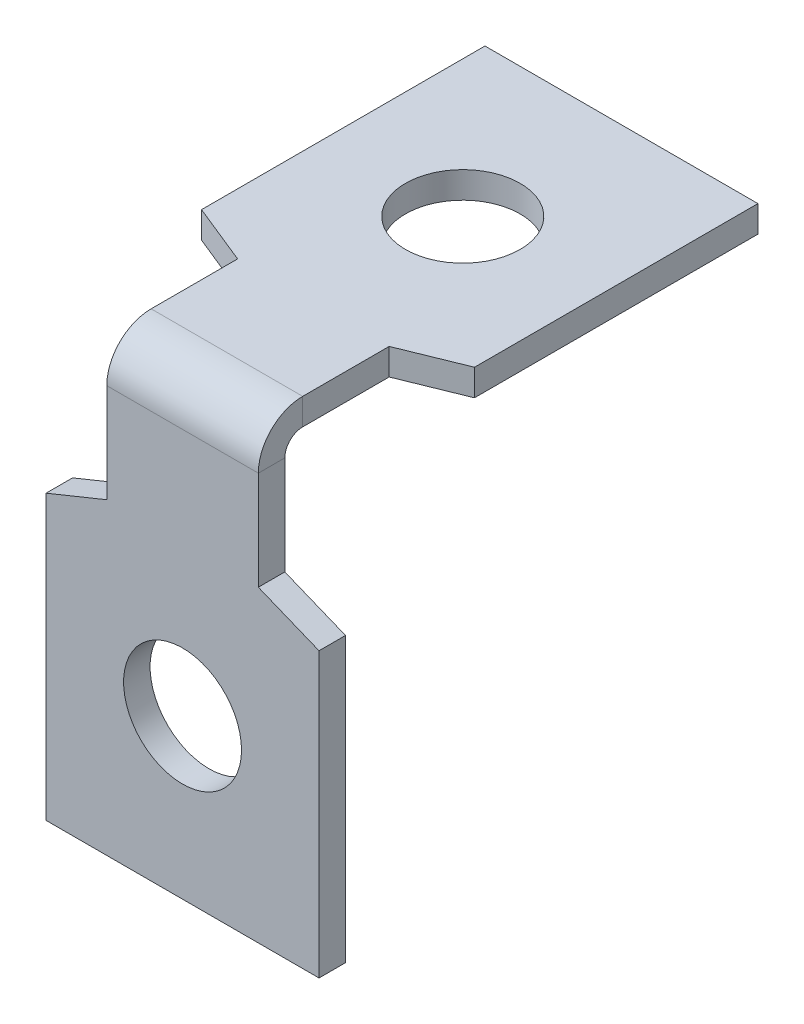
ISO-10303-21;
HEADER;
FILE_DESCRIPTION(('STEP AP214'),'2;1');
FILE_NAME('part.step','',(''),(''),'','','');
FILE_SCHEMA(('AUTOMOTIVE_DESIGN { 1 0 10303 214 1 1 1 1 }'));
ENDSEC;
DATA;
#1=APPLICATION_CONTEXT('core data for automotive mechanical design processes');
#2=APPLICATION_PROTOCOL_DEFINITION('international standard','automotive_design',2000,#1);
#3=PRODUCT_CONTEXT('',#1,'mechanical');
#4=PRODUCT('Part','Part','',(#3));
#5=PRODUCT_RELATED_PRODUCT_CATEGORY('part','',(#4));
#6=PRODUCT_DEFINITION_FORMATION('','',#4);
#7=PRODUCT_DEFINITION_CONTEXT('part definition',#1,'design');
#8=PRODUCT_DEFINITION('design','',#6,#7);
#9=PRODUCT_DEFINITION_SHAPE('','',#8);
#10=(LENGTH_UNIT() NAMED_UNIT(*) SI_UNIT(.MILLI.,.METRE.));
#11=(NAMED_UNIT(*) PLANE_ANGLE_UNIT() SI_UNIT($,.RADIAN.));
#12=(NAMED_UNIT(*) SI_UNIT($,.STERADIAN.) SOLID_ANGLE_UNIT());
#13=UNCERTAINTY_MEASURE_WITH_UNIT(LENGTH_MEASURE(1.E-05),#10,'distance_accuracy_value','');
#14=(GEOMETRIC_REPRESENTATION_CONTEXT(3) GLOBAL_UNCERTAINTY_ASSIGNED_CONTEXT((#13)) GLOBAL_UNIT_ASSIGNED_CONTEXT((#10,
#11,#12)) REPRESENTATION_CONTEXT('',''));
#15=CARTESIAN_POINT('',(0.,0.,0.));
#16=DIRECTION('',(0.,0.,1.));
#17=DIRECTION('',(1.,0.,0.));
#18=AXIS2_PLACEMENT_3D('',#15,#16,#17);
#19=CARTESIAN_POINT('',(0.,12.0608697758101,10.4181302241899));
#20=DIRECTION('',(0.,-1.,0.));
#21=DIRECTION('',(-1.,0.,0.));
#22=AXIS2_PLACEMENT_3D('',#19,#20,#21);
#23=PLANE('',#22);
#24=CARTESIAN_POINT('',(0.,12.0608697758101,-11.5528697758101));
#25=DIRECTION('',(0.,1.,0.));
#26=DIRECTION('',(1.,0.,0.));
#27=AXIS2_PLACEMENT_3D('',#24,#25,#26);
#28=CIRCLE('',#27,2.36295847969978);
#29=CARTESIAN_POINT('',(2.36295847969978,12.0608697758101,-11.5528697758101));
#30=VERTEX_POINT('',#29);
#31=EDGE_CURVE('E231',#30,#30,#28,.T.);
#32=ORIENTED_EDGE('',*,*,#31,.F.);
#33=EDGE_LOOP('',(#32));
#34=FACE_BOUND('',#33,.T.);
#35=DIRECTION('',(0.,0.,1.));
#36=VECTOR('',#35,1.);
#37=CARTESIAN_POINT('',(-3.1242,12.0608697758101,4.25863022418991));
#38=LINE('',#37,#36);
#39=CARTESIAN_POINT('',(-3.1242,12.0608697758101,-5.39336977581008));
#40=VERTEX_POINT('',#39);
#41=CARTESIAN_POINT('',(-3.1242,12.0608697758101,-1.8288));
#42=VERTEX_POINT('',#41);
#43=EDGE_CURVE('E58',#40,#42,#38,.T.);
#44=ORIENTED_EDGE('',*,*,#43,.T.);
#45=DIRECTION('',(1.,0.,0.));
#46=VECTOR('',#45,1.);
#47=CARTESIAN_POINT('',(0.,12.0608697758101,-1.8288));
#48=LINE('',#47,#46);
#49=CARTESIAN_POINT('',(3.1242,12.0608697758101,-1.8288));
#50=VERTEX_POINT('',#49);
#51=EDGE_CURVE('E50',#42,#50,#48,.T.);
#52=ORIENTED_EDGE('',*,*,#51,.T.);
#53=DIRECTION('',(0.,0.,-1.));
#54=VECTOR('',#53,1.);
#55=CARTESIAN_POINT('',(3.1242,12.0608697758101,-5.39336977581008));
#56=LINE('',#55,#54);
#57=CARTESIAN_POINT('',(3.1242,12.0608697758101,-5.39336977581008));
#58=VERTEX_POINT('',#57);
#59=EDGE_CURVE('E66',#50,#58,#56,.T.);
#60=ORIENTED_EDGE('',*,*,#59,.T.);
#61=DIRECTION('',(0.926517818130893,0.,-0.376250890611529));
#62=VECTOR('',#61,1.);
#63=CARTESIAN_POINT('',(5.6261,12.0608697758101,-6.40936977581008));
#64=LINE('',#63,#62);
#65=CARTESIAN_POINT('',(5.6261,12.0608697758101,-6.40936977581008));
#66=VERTEX_POINT('',#65);
#67=EDGE_CURVE('E257',#58,#66,#64,.T.);
#68=ORIENTED_EDGE('',*,*,#67,.T.);
#69=DIRECTION('',(0.,0.,-1.));
#70=VECTOR('',#69,1.);
#71=CARTESIAN_POINT('',(5.6261,12.06086977581,-18.0933697758101));
#72=LINE('',#71,#70);
#73=CARTESIAN_POINT('',(5.6261,12.06086977581,-18.0933697758101));
#74=VERTEX_POINT('',#73);
#75=EDGE_CURVE('E260',#66,#74,#72,.T.);
#76=ORIENTED_EDGE('',*,*,#75,.T.);
#77=DIRECTION('',(-1.,0.,0.));
#78=VECTOR('',#77,1.);
#79=CARTESIAN_POINT('',(-5.6261,12.06086977581,-18.0933697758101));
#80=LINE('',#79,#78);
#81=CARTESIAN_POINT('',(-5.6261,12.06086977581,-18.0933697758101));
#82=VERTEX_POINT('',#81);
#83=EDGE_CURVE('E239',#74,#82,#80,.T.);
#84=ORIENTED_EDGE('',*,*,#83,.T.);
#85=DIRECTION('',(0.,0.,1.));
#86=VECTOR('',#85,1.);
#87=CARTESIAN_POINT('',(-5.6261,12.0608697758101,-6.40936977581008));
#88=LINE('',#87,#86);
#89=CARTESIAN_POINT('',(-5.6261,12.0608697758101,-6.40936977581008));
#90=VERTEX_POINT('',#89);
#91=EDGE_CURVE('E230',#82,#90,#88,.T.);
#92=ORIENTED_EDGE('',*,*,#91,.T.);
#93=DIRECTION('',(0.926517818130893,0.,0.376250890611529));
#94=VECTOR('',#93,1.);
#95=CARTESIAN_POINT('',(-3.1242,12.0608697758101,-5.39336977581008));
#96=LINE('',#95,#94);
#97=EDGE_CURVE('E255',#90,#40,#96,.T.);
#98=ORIENTED_EDGE('',*,*,#97,.T.);
#99=EDGE_LOOP('',(#44,#52,#60,#68,#76,#84,#92,#98));
#100=FACE_BOUND('',#99,.T.);
#101=ADVANCED_FACE('F41',(#34,#100),#23,.F.);
#102=CARTESIAN_POINT('',(-5.6261,10.9686697758101,-6.40936977581008));
#103=DIRECTION('',(-1.,0.,0.));
#104=DIRECTION('',(0.,1.,0.));
#105=AXIS2_PLACEMENT_3D('',#102,#103,#104);
#106=PLANE('',#105);
#107=ORIENTED_EDGE('',*,*,#91,.F.);
#108=DIRECTION('',(0.,1.,0.));
#109=VECTOR('',#108,1.);
#110=CARTESIAN_POINT('',(-5.6261,10.96866977581,-18.0933697758101));
#111=LINE('',#110,#109);
#112=CARTESIAN_POINT('',(-5.6261,10.96866977581,-18.0933697758101));
#113=VERTEX_POINT('',#112);
#114=EDGE_CURVE('E265',#113,#82,#111,.T.);
#115=ORIENTED_EDGE('',*,*,#114,.F.);
#116=DIRECTION('',(0.,0.,1.));
#117=VECTOR('',#116,1.);
#118=CARTESIAN_POINT('',(-5.6261,10.9686697758101,-6.40936977581008));
#119=LINE('',#118,#117);
#120=CARTESIAN_POINT('',(-5.6261,10.9686697758101,-6.40936977581008));
#121=VERTEX_POINT('',#120);
#122=EDGE_CURVE('E235',#113,#121,#119,.T.);
#123=ORIENTED_EDGE('',*,*,#122,.T.);
#124=DIRECTION('',(0.,1.,0.));
#125=VECTOR('',#124,1.);
#126=CARTESIAN_POINT('',(-5.6261,10.9686697758101,-6.40936977581008));
#127=LINE('',#126,#125);
#128=EDGE_CURVE('E252',#121,#90,#127,.T.);
#129=ORIENTED_EDGE('',*,*,#128,.T.);
#130=EDGE_LOOP('',(#107,#115,#123,#129));
#131=FACE_BOUND('',#130,.T.);
#132=ADVANCED_FACE('F301',(#131),#106,.T.);
#133=CARTESIAN_POINT('',(-5.6261,10.96866977581,-18.0933697758101));
#134=DIRECTION('',(0.,0.,-1.));
#135=DIRECTION('',(0.,1.,0.));
#136=AXIS2_PLACEMENT_3D('',#133,#134,#135);
#137=PLANE('',#136);
#138=ORIENTED_EDGE('',*,*,#83,.F.);
#139=DIRECTION('',(0.,1.,0.));
#140=VECTOR('',#139,1.);
#141=CARTESIAN_POINT('',(5.6261,10.96866977581,-18.0933697758101));
#142=LINE('',#141,#140);
#143=CARTESIAN_POINT('',(5.6261,10.96866977581,-18.0933697758101));
#144=VERTEX_POINT('',#143);
#145=EDGE_CURVE('E267',#144,#74,#142,.T.);
#146=ORIENTED_EDGE('',*,*,#145,.F.);
#147=DIRECTION('',(-1.,0.,0.));
#148=VECTOR('',#147,1.);
#149=CARTESIAN_POINT('',(-5.6261,10.96866977581,-18.0933697758101));
#150=LINE('',#149,#148);
#151=EDGE_CURVE('E249',#144,#113,#150,.T.);
#152=ORIENTED_EDGE('',*,*,#151,.T.);
#153=ORIENTED_EDGE('',*,*,#114,.T.);
#154=EDGE_LOOP('',(#138,#146,#152,#153));
#155=FACE_BOUND('',#154,.T.);
#156=ADVANCED_FACE('F296',(#155),#137,.T.);
#157=CARTESIAN_POINT('',(5.6261,10.96866977581,-18.0933697758101));
#158=DIRECTION('',(1.,0.,0.));
#159=DIRECTION('',(0.,0.,-1.));
#160=AXIS2_PLACEMENT_3D('',#157,#158,#159);
#161=PLANE('',#160);
#162=ORIENTED_EDGE('',*,*,#75,.F.);
#163=DIRECTION('',(0.,1.,0.));
#164=VECTOR('',#163,1.);
#165=CARTESIAN_POINT('',(5.6261,10.9686697758101,-6.40936977581008));
#166=LINE('',#165,#164);
#167=CARTESIAN_POINT('',(5.6261,10.9686697758101,-6.40936977581008));
#168=VERTEX_POINT('',#167);
#169=EDGE_CURVE('E269',#168,#66,#166,.T.);
#170=ORIENTED_EDGE('',*,*,#169,.F.);
#171=DIRECTION('',(0.,0.,-1.));
#172=VECTOR('',#171,1.);
#173=CARTESIAN_POINT('',(5.6261,10.96866977581,-18.0933697758101));
#174=LINE('',#173,#172);
#175=EDGE_CURVE('E246',#168,#144,#174,.T.);
#176=ORIENTED_EDGE('',*,*,#175,.T.);
#177=ORIENTED_EDGE('',*,*,#145,.T.);
#178=EDGE_LOOP('',(#162,#170,#176,#177));
#179=FACE_BOUND('',#178,.T.);
#180=ADVANCED_FACE('F293',(#179),#161,.T.);
#181=CARTESIAN_POINT('',(5.6261,10.9686697758101,-6.40936977581008));
#182=DIRECTION('',(0.376250890611529,0.,0.926517818130893));
#183=DIRECTION('',(0.926517818130893,0.,-0.376250890611529));
#184=AXIS2_PLACEMENT_3D('',#181,#182,#183);
#185=PLANE('',#184);
#186=ORIENTED_EDGE('',*,*,#67,.F.);
#187=DIRECTION('',(0.,1.,0.));
#188=VECTOR('',#187,1.);
#189=CARTESIAN_POINT('',(3.1242,10.9686697758101,-5.39336977581008));
#190=LINE('',#189,#188);
#191=CARTESIAN_POINT('',(3.1242,10.9686697758101,-5.39336977581008));
#192=VERTEX_POINT('',#191);
#193=EDGE_CURVE('E271',#192,#58,#190,.T.);
#194=ORIENTED_EDGE('',*,*,#193,.F.);
#195=DIRECTION('',(0.926517818130893,0.,-0.376250890611529));
#196=VECTOR('',#195,1.);
#197=CARTESIAN_POINT('',(5.6261,10.9686697758101,-6.40936977581008));
#198=LINE('',#197,#196);
#199=EDGE_CURVE('E243',#192,#168,#198,.T.);
#200=ORIENTED_EDGE('',*,*,#199,.T.);
#201=ORIENTED_EDGE('',*,*,#169,.T.);
#202=EDGE_LOOP('',(#186,#194,#200,#201));
#203=FACE_BOUND('',#202,.T.);
#204=ADVANCED_FACE('F289',(#203),#185,.T.);
#205=CARTESIAN_POINT('',(3.1242,10.9686697758101,-5.39336977581008));
#206=DIRECTION('',(1.,0.,0.));
#207=DIRECTION('',(0.,-1.,0.));
#208=AXIS2_PLACEMENT_3D('',#205,#206,#207);
#209=PLANE('',#208);
#210=DIRECTION('',(0.,1.,0.));
#211=VECTOR('',#210,1.);
#212=CARTESIAN_POINT('',(3.1242,10.9686697758101,-1.8288));
#213=LINE('',#212,#211);
#214=CARTESIAN_POINT('',(3.1242,10.9686697758101,-1.82880000000001));
#215=VERTEX_POINT('',#214);
#216=EDGE_CURVE('E277',#215,#50,#213,.T.);
#217=ORIENTED_EDGE('',*,*,#216,.F.);
#218=DIRECTION('',(0.,0.,-1.));
#219=VECTOR('',#218,1.);
#220=CARTESIAN_POINT('',(3.1242,10.9686697758101,-5.39336977581008));
#221=LINE('',#220,#219);
#222=EDGE_CURVE('E45',#215,#192,#221,.T.);
#223=ORIENTED_EDGE('',*,*,#222,.T.);
#224=ORIENTED_EDGE('',*,*,#193,.T.);
#225=ORIENTED_EDGE('',*,*,#59,.F.);
#226=EDGE_LOOP('',(#217,#223,#224,#225));
#227=FACE_BOUND('',#226,.T.);
#228=ADVANCED_FACE('F285',(#227),#209,.T.);
#229=CARTESIAN_POINT('',(-3.1242,10.9686697758101,4.25863022418992));
#230=DIRECTION('',(-1.,0.,0.));
#231=DIRECTION('',(0.,1.,0.));
#232=AXIS2_PLACEMENT_3D('',#229,#230,#231);
#233=PLANE('',#232);
#234=DIRECTION('',(0.,-1.,0.));
#235=VECTOR('',#234,1.);
#236=CARTESIAN_POINT('',(-3.1242,10.9686697758101,-1.8288));
#237=LINE('',#236,#235);
#238=CARTESIAN_POINT('',(-3.1242,10.9686697758101,-1.8288));
#239=VERTEX_POINT('',#238);
#240=EDGE_CURVE('E12',#42,#239,#237,.T.);
#241=ORIENTED_EDGE('',*,*,#240,.F.);
#242=ORIENTED_EDGE('',*,*,#43,.F.);
#243=DIRECTION('',(0.,1.,0.));
#244=VECTOR('',#243,1.);
#245=CARTESIAN_POINT('',(-3.1242,10.9686697758101,-5.39336977581008));
#246=LINE('',#245,#244);
#247=CARTESIAN_POINT('',(-3.1242,10.9686697758101,-5.39336977581008));
#248=VERTEX_POINT('',#247);
#249=EDGE_CURVE('E273',#248,#40,#246,.T.);
#250=ORIENTED_EDGE('',*,*,#249,.F.);
#251=DIRECTION('',(0.,0.,1.));
#252=VECTOR('',#251,1.);
#253=CARTESIAN_POINT('',(-3.1242,10.9686697758101,4.25863022418992));
#254=LINE('',#253,#252);
#255=EDGE_CURVE('E242',#248,#239,#254,.T.);
#256=ORIENTED_EDGE('',*,*,#255,.T.);
#257=EDGE_LOOP('',(#241,#242,#250,#256));
#258=FACE_BOUND('',#257,.T.);
#259=ADVANCED_FACE('F43',(#258),#233,.T.);
#260=CARTESIAN_POINT('',(-3.1242,10.9686697758101,-5.39336977581008));
#261=DIRECTION('',(-0.376250890611529,0.,0.926517818130893));
#262=DIRECTION('',(0.926517818130893,0.,0.376250890611529));
#263=AXIS2_PLACEMENT_3D('',#260,#261,#262);
#264=PLANE('',#263);
#265=ORIENTED_EDGE('',*,*,#97,.F.);
#266=ORIENTED_EDGE('',*,*,#128,.F.);
#267=DIRECTION('',(0.926517818130893,0.,0.376250890611529));
#268=VECTOR('',#267,1.);
#269=CARTESIAN_POINT('',(-3.1242,10.9686697758101,-5.39336977581008));
#270=LINE('',#269,#268);
#271=EDGE_CURVE('E238',#121,#248,#270,.T.);
#272=ORIENTED_EDGE('',*,*,#271,.T.);
#273=ORIENTED_EDGE('',*,*,#249,.T.);
#274=EDGE_LOOP('',(#265,#266,#272,#273));
#275=FACE_BOUND('',#274,.T.);
#276=ADVANCED_FACE('F304',(#275),#264,.T.);
#277=CARTESIAN_POINT('',(0.,10.9686697758101,10.4181302241899));
#278=DIRECTION('',(0.,-1.,0.));
#279=DIRECTION('',(-1.,0.,0.));
#280=AXIS2_PLACEMENT_3D('',#277,#278,#279);
#281=PLANE('',#280);
#282=DIRECTION('',(1.,0.,0.));
#283=VECTOR('',#282,1.);
#284=CARTESIAN_POINT('',(0.,10.9686697758101,-1.8288));
#285=LINE('',#284,#283);
#286=EDGE_CURVE('E178',#239,#215,#285,.T.);
#287=ORIENTED_EDGE('',*,*,#286,.F.);
#288=ORIENTED_EDGE('',*,*,#255,.F.);
#289=ORIENTED_EDGE('',*,*,#271,.F.);
#290=ORIENTED_EDGE('',*,*,#122,.F.);
#291=ORIENTED_EDGE('',*,*,#151,.F.);
#292=ORIENTED_EDGE('',*,*,#175,.F.);
#293=ORIENTED_EDGE('',*,*,#199,.F.);
#294=ORIENTED_EDGE('',*,*,#222,.F.);
#295=EDGE_LOOP('',(#287,#288,#289,#290,#291,#292,#293,#294));
#296=FACE_BOUND('',#295,.T.);
#297=CARTESIAN_POINT('',(0.,10.9686697758101,-11.5528697758101));
#298=DIRECTION('',(0.,1.,0.));
#299=DIRECTION('',(1.,0.,0.));
#300=AXIS2_PLACEMENT_3D('',#297,#298,#299);
#301=CIRCLE('',#300,2.36295847969978);
#302=CARTESIAN_POINT('',(2.36295847969978,10.9686697758101,-11.5528697758101));
#303=VERTEX_POINT('',#302);
#304=EDGE_CURVE('E227',#303,#303,#301,.T.);
#305=ORIENTED_EDGE('',*,*,#304,.T.);
#306=EDGE_LOOP('',(#305));
#307=FACE_BOUND('',#306,.T.);
#308=ADVANCED_FACE('F387',(#296,#307),#281,.T.);
#309=CARTESIAN_POINT('',(0.,10.9686697758101,-11.5528697758101));
#310=DIRECTION('',(0.,1.,0.));
#311=DIRECTION('',(1.,0.,0.));
#312=AXIS2_PLACEMENT_3D('',#309,#310,#311);
#313=CYLINDRICAL_SURFACE('',#312,2.36295847969978);
#314=ORIENTED_EDGE('',*,*,#304,.F.);
#315=EDGE_LOOP('',(#314));
#316=FACE_BOUND('',#315,.T.);
#317=ORIENTED_EDGE('',*,*,#31,.T.);
#318=EDGE_LOOP('',(#317));
#319=FACE_BOUND('',#318,.T.);
#320=ADVANCED_FACE('F389',(#316,#319),#313,.F.);
#321=CARTESIAN_POINT('',(-5.6261,5.1435,-1.0922));
#322=DIRECTION('',(-0.376250890611529,0.926517818130893,0.));
#323=DIRECTION('',(-0.926517818130893,-0.376250890611529,0.));
#324=AXIS2_PLACEMENT_3D('',#321,#322,#323);
#325=PLANE('',#324);
#326=DIRECTION('',(-0.926517818130893,-0.376250890611529,0.));
#327=VECTOR('',#326,1.);
#328=CARTESIAN_POINT('',(-5.6261,5.1435,0.));
#329=LINE('',#328,#327);
#330=CARTESIAN_POINT('',(-3.1242,6.1595,0.));
#331=VERTEX_POINT('',#330);
#332=CARTESIAN_POINT('',(-5.6261,5.1435,0.));
#333=VERTEX_POINT('',#332);
#334=EDGE_CURVE('E340',#331,#333,#329,.T.);
#335=ORIENTED_EDGE('',*,*,#334,.F.);
#336=DIRECTION('',(0.,0.,1.));
#337=VECTOR('',#336,1.);
#338=CARTESIAN_POINT('',(-3.1242,6.1595,-1.0922));
#339=LINE('',#338,#337);
#340=CARTESIAN_POINT('',(-3.1242,6.1595,-1.0922));
#341=VERTEX_POINT('',#340);
#342=EDGE_CURVE('E234',#341,#331,#339,.T.);
#343=ORIENTED_EDGE('',*,*,#342,.F.);
#344=DIRECTION('',(-0.926517818130893,-0.376250890611529,0.));
#345=VECTOR('',#344,1.);
#346=CARTESIAN_POINT('',(-5.6261,5.1435,-1.0922));
#347=LINE('',#346,#345);
#348=CARTESIAN_POINT('',(-5.6261,5.1435,-1.0922));
#349=VERTEX_POINT('',#348);
#350=EDGE_CURVE('E223',#341,#349,#347,.T.);
#351=ORIENTED_EDGE('',*,*,#350,.T.);
#352=DIRECTION('',(0.,0.,1.));
#353=VECTOR('',#352,1.);
#354=CARTESIAN_POINT('',(-5.6261,5.1435,-1.0922));
#355=LINE('',#354,#353);
#356=EDGE_CURVE('E221',#349,#333,#355,.T.);
#357=ORIENTED_EDGE('',*,*,#356,.T.);
#358=EDGE_LOOP('',(#335,#343,#351,#357));
#359=FACE_BOUND('',#358,.T.);
#360=ADVANCED_FACE('F351',(#359),#325,.T.);
#361=CARTESIAN_POINT('',(-5.6261,-6.5405,-1.0922));
#362=DIRECTION('',(-1.,0.,0.));
#363=DIRECTION('',(0.,0.,1.));
#364=AXIS2_PLACEMENT_3D('',#361,#362,#363);
#365=PLANE('',#364);
#366=DIRECTION('',(0.,-1.,0.));
#367=VECTOR('',#366,1.);
#368=CARTESIAN_POINT('',(-5.6261,-6.5405,0.));
#369=LINE('',#368,#367);
#370=CARTESIAN_POINT('',(-5.6261,-6.5405,0.));
#371=VERTEX_POINT('',#370);
#372=EDGE_CURVE('E337',#333,#371,#369,.T.);
#373=ORIENTED_EDGE('',*,*,#372,.F.);
#374=ORIENTED_EDGE('',*,*,#356,.F.);
#375=DIRECTION('',(0.,-1.,0.));
#376=VECTOR('',#375,1.);
#377=CARTESIAN_POINT('',(-5.6261,-6.5405,-1.0922));
#378=LINE('',#377,#376);
#379=CARTESIAN_POINT('',(-5.6261,-6.5405,-1.0922));
#380=VERTEX_POINT('',#379);
#381=EDGE_CURVE('E218',#349,#380,#378,.T.);
#382=ORIENTED_EDGE('',*,*,#381,.T.);
#383=DIRECTION('',(0.,0.,1.));
#384=VECTOR('',#383,1.);
#385=CARTESIAN_POINT('',(-5.6261,-6.5405,-1.0922));
#386=LINE('',#385,#384);
#387=EDGE_CURVE('E216',#380,#371,#386,.T.);
#388=ORIENTED_EDGE('',*,*,#387,.T.);
#389=EDGE_LOOP('',(#373,#374,#382,#388));
#390=FACE_BOUND('',#389,.T.);
#391=ADVANCED_FACE('F355',(#390),#365,.T.);
#392=CARTESIAN_POINT('',(5.6261,-6.5405,-1.0922));
#393=DIRECTION('',(0.,-1.,0.));
#394=DIRECTION('',(0.,0.,-1.));
#395=AXIS2_PLACEMENT_3D('',#392,#393,#394);
#396=PLANE('',#395);
#397=DIRECTION('',(1.,0.,0.));
#398=VECTOR('',#397,1.);
#399=CARTESIAN_POINT('',(5.6261,-6.5405,0.));
#400=LINE('',#399,#398);
#401=CARTESIAN_POINT('',(5.6261,-6.5405,0.));
#402=VERTEX_POINT('',#401);
#403=EDGE_CURVE('E334',#371,#402,#400,.T.);
#404=ORIENTED_EDGE('',*,*,#403,.F.);
#405=ORIENTED_EDGE('',*,*,#387,.F.);
#406=DIRECTION('',(1.,0.,0.));
#407=VECTOR('',#406,1.);
#408=CARTESIAN_POINT('',(5.6261,-6.5405,-1.0922));
#409=LINE('',#408,#407);
#410=CARTESIAN_POINT('',(5.6261,-6.5405,-1.0922));
#411=VERTEX_POINT('',#410);
#412=EDGE_CURVE('E213',#380,#411,#409,.T.);
#413=ORIENTED_EDGE('',*,*,#412,.T.);
#414=DIRECTION('',(0.,0.,1.));
#415=VECTOR('',#414,1.);
#416=CARTESIAN_POINT('',(5.6261,-6.5405,-1.0922));
#417=LINE('',#416,#415);
#418=EDGE_CURVE('E211',#411,#402,#417,.T.);
#419=ORIENTED_EDGE('',*,*,#418,.T.);
#420=EDGE_LOOP('',(#404,#405,#413,#419));
#421=FACE_BOUND('',#420,.T.);
#422=ADVANCED_FACE('F359',(#421),#396,.T.);
#423=CARTESIAN_POINT('',(5.6261,5.1435,-1.0922));
#424=DIRECTION('',(1.,0.,0.));
#425=DIRECTION('',(0.,1.,0.));
#426=AXIS2_PLACEMENT_3D('',#423,#424,#425);
#427=PLANE('',#426);
#428=DIRECTION('',(0.,1.,0.));
#429=VECTOR('',#428,1.);
#430=CARTESIAN_POINT('',(5.6261,5.1435,0.));
#431=LINE('',#430,#429);
#432=CARTESIAN_POINT('',(5.6261,5.1435,0.));
#433=VERTEX_POINT('',#432);
#434=EDGE_CURVE('E331',#402,#433,#431,.T.);
#435=ORIENTED_EDGE('',*,*,#434,.F.);
#436=ORIENTED_EDGE('',*,*,#418,.F.);
#437=DIRECTION('',(0.,1.,0.));
#438=VECTOR('',#437,1.);
#439=CARTESIAN_POINT('',(5.6261,5.1435,-1.0922));
#440=LINE('',#439,#438);
#441=CARTESIAN_POINT('',(5.6261,5.1435,-1.0922));
#442=VERTEX_POINT('',#441);
#443=EDGE_CURVE('E208',#411,#442,#440,.T.);
#444=ORIENTED_EDGE('',*,*,#443,.T.);
#445=DIRECTION('',(0.,0.,1.));
#446=VECTOR('',#445,1.);
#447=CARTESIAN_POINT('',(5.6261,5.1435,-1.0922));
#448=LINE('',#447,#446);
#449=EDGE_CURVE('E206',#442,#433,#448,.T.);
#450=ORIENTED_EDGE('',*,*,#449,.T.);
#451=EDGE_LOOP('',(#435,#436,#444,#450));
#452=FACE_BOUND('',#451,.T.);
#453=ADVANCED_FACE('F363',(#452),#427,.T.);
#454=CARTESIAN_POINT('',(3.1242,6.1595,-1.0922));
#455=DIRECTION('',(0.376250890611529,0.926517818130894,0.));
#456=DIRECTION('',(-0.926517818130894,0.376250890611529,0.));
#457=AXIS2_PLACEMENT_3D('',#454,#455,#456);
#458=PLANE('',#457);
#459=DIRECTION('',(-0.926517818130894,0.376250890611529,0.));
#460=VECTOR('',#459,1.);
#461=CARTESIAN_POINT('',(3.1242,6.1595,0.));
#462=LINE('',#461,#460);
#463=CARTESIAN_POINT('',(3.1242,6.1595,0.));
#464=VERTEX_POINT('',#463);
#465=EDGE_CURVE('E328',#433,#464,#462,.T.);
#466=ORIENTED_EDGE('',*,*,#465,.F.);
#467=ORIENTED_EDGE('',*,*,#449,.F.);
#468=DIRECTION('',(-0.926517818130894,0.376250890611529,0.));
#469=VECTOR('',#468,1.);
#470=CARTESIAN_POINT('',(3.1242,6.1595,-1.0922));
#471=LINE('',#470,#469);
#472=CARTESIAN_POINT('',(3.1242,6.1595,-1.0922));
#473=VERTEX_POINT('',#472);
#474=EDGE_CURVE('E204',#442,#473,#471,.T.);
#475=ORIENTED_EDGE('',*,*,#474,.T.);
#476=DIRECTION('',(0.,0.,1.));
#477=VECTOR('',#476,1.);
#478=CARTESIAN_POINT('',(3.1242,6.1595,-1.0922));
#479=LINE('',#478,#477);
#480=EDGE_CURVE('E194',#473,#464,#479,.T.);
#481=ORIENTED_EDGE('',*,*,#480,.T.);
#482=EDGE_LOOP('',(#466,#467,#475,#481));
#483=FACE_BOUND('',#482,.T.);
#484=ADVANCED_FACE('F366',(#483),#458,.T.);
#485=CARTESIAN_POINT('',(0.,0.,-1.0922));
#486=DIRECTION('',(0.,0.,1.));
#487=DIRECTION('',(1.,0.,0.));
#488=AXIS2_PLACEMENT_3D('',#485,#486,#487);
#489=CYLINDRICAL_SURFACE('',#488,2.43087073521856);
#490=CARTESIAN_POINT('',(0.,0.,-1.0922));
#491=DIRECTION('',(0.,0.,1.));
#492=DIRECTION('',(1.,0.,0.));
#493=AXIS2_PLACEMENT_3D('',#490,#491,#492);
#494=CIRCLE('',#493,2.43087073521856);
#495=CARTESIAN_POINT('',(2.43087073521856,0.,-1.0922));
#496=VERTEX_POINT('',#495);
#497=EDGE_CURVE('E191',#496,#496,#494,.T.);
#498=ORIENTED_EDGE('',*,*,#497,.F.);
#499=EDGE_LOOP('',(#498));
#500=FACE_BOUND('',#499,.T.);
#501=CARTESIAN_POINT('',(0.,0.,0.));
#502=DIRECTION('',(0.,0.,1.));
#503=DIRECTION('',(1.,0.,0.));
#504=AXIS2_PLACEMENT_3D('',#501,#502,#503);
#505=CIRCLE('',#504,2.43087073521856);
#506=CARTESIAN_POINT('',(2.43087073521856,0.,0.));
#507=VERTEX_POINT('',#506);
#508=EDGE_CURVE('E200',#507,#507,#505,.T.);
#509=ORIENTED_EDGE('',*,*,#508,.T.);
#510=EDGE_LOOP('',(#509));
#511=FACE_BOUND('',#510,.T.);
#512=ADVANCED_FACE('F368',(#500,#511),#489,.F.);
#513=CARTESIAN_POINT('',(0.,0.,-1.0922));
#514=DIRECTION('',(0.,0.,-1.));
#515=DIRECTION('',(-1.,0.,0.));
#516=AXIS2_PLACEMENT_3D('',#513,#514,#515);
#517=PLANE('',#516);
#518=ORIENTED_EDGE('',*,*,#497,.T.);
#519=EDGE_LOOP('',(#518));
#520=FACE_BOUND('',#519,.T.);
#521=DIRECTION('',(0.,-1.,0.));
#522=VECTOR('',#521,1.);
#523=CARTESIAN_POINT('',(-3.1242,6.1595,-1.0922));
#524=LINE('',#523,#522);
#525=CARTESIAN_POINT('',(-3.1242,10.2320697758101,-1.0922));
#526=VERTEX_POINT('',#525);
#527=EDGE_CURVE('E189',#526,#341,#524,.T.);
#528=ORIENTED_EDGE('',*,*,#527,.F.);
#529=DIRECTION('',(1.,0.,0.));
#530=VECTOR('',#529,1.);
#531=CARTESIAN_POINT('',(0.,10.2320697758101,-1.0922));
#532=LINE('',#531,#530);
#533=CARTESIAN_POINT('',(3.1242,10.2320697758101,-1.0922));
#534=VERTEX_POINT('',#533);
#535=EDGE_CURVE('E176',#526,#534,#532,.T.);
#536=ORIENTED_EDGE('',*,*,#535,.T.);
#537=DIRECTION('',(0.,1.,0.));
#538=VECTOR('',#537,1.);
#539=CARTESIAN_POINT('',(3.1242,15.8115,-1.0922));
#540=LINE('',#539,#538);
#541=EDGE_CURVE('E169',#473,#534,#540,.T.);
#542=ORIENTED_EDGE('',*,*,#541,.F.);
#543=ORIENTED_EDGE('',*,*,#474,.F.);
#544=ORIENTED_EDGE('',*,*,#443,.F.);
#545=ORIENTED_EDGE('',*,*,#412,.F.);
#546=ORIENTED_EDGE('',*,*,#381,.F.);
#547=ORIENTED_EDGE('',*,*,#350,.F.);
#548=EDGE_LOOP('',(#528,#536,#542,#543,#544,#545,#546,#547));
#549=FACE_BOUND('',#548,.T.);
#550=ADVANCED_FACE('F185',(#520,#549),#517,.T.);
#551=CARTESIAN_POINT('',(3.1242,15.8115,-1.0922));
#552=DIRECTION('',(1.,0.,0.));
#553=DIRECTION('',(0.,0.,-1.));
#554=AXIS2_PLACEMENT_3D('',#551,#552,#553);
#555=PLANE('',#554);
#556=ORIENTED_EDGE('',*,*,#541,.T.);
#557=DIRECTION('',(0.,0.,1.));
#558=VECTOR('',#557,1.);
#559=CARTESIAN_POINT('',(3.1242,10.2320697758101,-1.09220000000004));
#560=LINE('',#559,#558);
#561=CARTESIAN_POINT('',(3.1242,10.2320697758101,0.));
#562=VERTEX_POINT('',#561);
#563=EDGE_CURVE('E157',#534,#562,#560,.T.);
#564=ORIENTED_EDGE('',*,*,#563,.T.);
#565=DIRECTION('',(0.,1.,0.));
#566=VECTOR('',#565,1.);
#567=CARTESIAN_POINT('',(3.1242,15.8115,0.));
#568=LINE('',#567,#566);
#569=EDGE_CURVE('E325',#464,#562,#568,.T.);
#570=ORIENTED_EDGE('',*,*,#569,.F.);
#571=ORIENTED_EDGE('',*,*,#480,.F.);
#572=EDGE_LOOP('',(#556,#564,#570,#571));
#573=FACE_BOUND('',#572,.T.);
#574=ADVANCED_FACE('F193',(#573),#555,.T.);
#575=CARTESIAN_POINT('',(0.,0.,0.));
#576=DIRECTION('',(0.,0.,-1.));
#577=DIRECTION('',(-1.,0.,0.));
#578=AXIS2_PLACEMENT_3D('',#575,#576,#577);
#579=PLANE('',#578);
#580=DIRECTION('',(1.,0.,0.));
#581=VECTOR('',#580,1.);
#582=CARTESIAN_POINT('',(0.,10.2320697758101,0.));
#583=LINE('',#582,#581);
#584=CARTESIAN_POINT('',(-3.1242,10.2320697758101,0.));
#585=VERTEX_POINT('',#584);
#586=EDGE_CURVE('E179',#585,#562,#583,.T.);
#587=ORIENTED_EDGE('',*,*,#586,.F.);
#588=DIRECTION('',(0.,-1.,0.));
#589=VECTOR('',#588,1.);
#590=CARTESIAN_POINT('',(-3.1242,6.1595,0.));
#591=LINE('',#590,#589);
#592=EDGE_CURVE('E168',#585,#331,#591,.T.);
#593=ORIENTED_EDGE('',*,*,#592,.T.);
#594=ORIENTED_EDGE('',*,*,#334,.T.);
#595=ORIENTED_EDGE('',*,*,#372,.T.);
#596=ORIENTED_EDGE('',*,*,#403,.T.);
#597=ORIENTED_EDGE('',*,*,#434,.T.);
#598=ORIENTED_EDGE('',*,*,#465,.T.);
#599=ORIENTED_EDGE('',*,*,#569,.T.);
#600=EDGE_LOOP('',(#587,#593,#594,#595,#596,#597,#598,#599));
#601=FACE_BOUND('',#600,.T.);
#602=ORIENTED_EDGE('',*,*,#508,.F.);
#603=EDGE_LOOP('',(#602));
#604=FACE_BOUND('',#603,.T.);
#605=ADVANCED_FACE('F344',(#601,#604),#579,.F.);
#606=CARTESIAN_POINT('',(-3.1242,6.1595,-1.0922));
#607=DIRECTION('',(-1.,0.,0.));
#608=DIRECTION('',(0.,0.,1.));
#609=AXIS2_PLACEMENT_3D('',#606,#607,#608);
#610=PLANE('',#609);
#611=ORIENTED_EDGE('',*,*,#592,.F.);
#612=DIRECTION('',(0.,0.,-1.));
#613=VECTOR('',#612,1.);
#614=CARTESIAN_POINT('',(-3.1242,10.2320697758101,-1.09219999999997));
#615=LINE('',#614,#613);
#616=EDGE_CURVE('E316',#585,#526,#615,.T.);
#617=ORIENTED_EDGE('',*,*,#616,.T.);
#618=ORIENTED_EDGE('',*,*,#527,.T.);
#619=ORIENTED_EDGE('',*,*,#342,.T.);
#620=EDGE_LOOP('',(#611,#617,#618,#619));
#621=FACE_BOUND('',#620,.T.);
#622=ADVANCED_FACE('F349',(#621),#610,.T.);
#623=CARTESIAN_POINT('',(-3.1242,10.2320697758101,-1.8288));
#624=DIRECTION('',(1.,0.,0.));
#625=DIRECTION('',(0.,0.,-1.));
#626=AXIS2_PLACEMENT_3D('',#623,#624,#625);
#627=PLANE('',#626);
#628=ORIENTED_EDGE('',*,*,#616,.F.);
#629=CARTESIAN_POINT('',(-3.1242,10.2320697758101,-1.8288));
#630=DIRECTION('',(1.,0.,0.));
#631=DIRECTION('',(0.,0.,-1.));
#632=AXIS2_PLACEMENT_3D('',#629,#630,#631);
#633=CIRCLE('',#632,1.8288);
#634=EDGE_CURVE('E313',#585,#42,#633,.F.);
#635=ORIENTED_EDGE('',*,*,#634,.T.);
#636=ORIENTED_EDGE('',*,*,#240,.T.);
#637=CARTESIAN_POINT('',(-3.1242,10.2320697758101,-1.8288));
#638=DIRECTION('',(-1.,0.,0.));
#639=DIRECTION('',(0.,0.,-1.));
#640=AXIS2_PLACEMENT_3D('',#637,#638,#639);
#641=CIRCLE('',#640,0.7366);
#642=EDGE_CURVE('E180',#526,#239,#641,.T.);
#643=ORIENTED_EDGE('',*,*,#642,.F.);
#644=EDGE_LOOP('',(#628,#635,#636,#643));
#645=FACE_BOUND('',#644,.T.);
#646=ADVANCED_FACE('F315',(#645),#627,.F.);
#647=CARTESIAN_POINT('',(3.1242,10.2320697758101,-1.8288));
#648=DIRECTION('',(-1.,0.,0.));
#649=DIRECTION('',(0.,0.,1.));
#650=AXIS2_PLACEMENT_3D('',#647,#648,#649);
#651=PLANE('',#650);
#652=CARTESIAN_POINT('',(3.1242,10.2320697758101,-1.8288));
#653=DIRECTION('',(1.,0.,0.));
#654=DIRECTION('',(0.,0.,-1.));
#655=AXIS2_PLACEMENT_3D('',#652,#653,#654);
#656=CIRCLE('',#655,1.8288);
#657=EDGE_CURVE('E163',#50,#562,#656,.T.);
#658=ORIENTED_EDGE('',*,*,#657,.T.);
#659=ORIENTED_EDGE('',*,*,#563,.F.);
#660=CARTESIAN_POINT('',(3.1242,10.2320697758101,-1.8288));
#661=DIRECTION('',(1.,0.,0.));
#662=DIRECTION('',(0.,0.,1.));
#663=AXIS2_PLACEMENT_3D('',#660,#661,#662);
#664=CIRCLE('',#663,0.7366);
#665=EDGE_CURVE('E161',#215,#534,#664,.T.);
#666=ORIENTED_EDGE('',*,*,#665,.F.);
#667=ORIENTED_EDGE('',*,*,#216,.T.);
#668=EDGE_LOOP('',(#658,#659,#666,#667));
#669=FACE_BOUND('',#668,.T.);
#670=ADVANCED_FACE('F159',(#669),#651,.F.);
#671=CARTESIAN_POINT('',(-6.65545385578214,10.2320697758101,-1.8288));
#672=DIRECTION('',(1.,0.,0.));
#673=DIRECTION('',(0.,0.,-1.));
#674=AXIS2_PLACEMENT_3D('',#671,#672,#673);
#675=CYLINDRICAL_SURFACE('',#674,0.7366);
#676=ORIENTED_EDGE('',*,*,#286,.T.);
#677=ORIENTED_EDGE('',*,*,#665,.T.);
#678=ORIENTED_EDGE('',*,*,#535,.F.);
#679=ORIENTED_EDGE('',*,*,#642,.T.);
#680=EDGE_LOOP('',(#676,#677,#678,#679));
#681=FACE_BOUND('',#680,.T.);
#682=ADVANCED_FACE('F174',(#681),#675,.F.);
#683=CARTESIAN_POINT('',(-6.65545385578214,10.2320697758101,-1.8288));
#684=DIRECTION('',(1.,0.,0.));
#685=DIRECTION('',(0.,0.,-1.));
#686=AXIS2_PLACEMENT_3D('',#683,#684,#685);
#687=CYLINDRICAL_SURFACE('',#686,1.8288);
#688=ORIENTED_EDGE('',*,*,#51,.F.);
#689=ORIENTED_EDGE('',*,*,#634,.F.);
#690=ORIENTED_EDGE('',*,*,#586,.T.);
#691=ORIENTED_EDGE('',*,*,#657,.F.);
#692=EDGE_LOOP('',(#688,#689,#690,#691));
#693=FACE_BOUND('',#692,.T.);
#694=ADVANCED_FACE('F312',(#693),#687,.T.);
#695=CLOSED_SHELL('',(#101,#132,#156,#180,#204,#228,#259,#276,#308,#320,#360,#391,#422,#453,
#484,#512,#550,#574,#605,#622,#646,#670,#682,#694));
#696=MANIFOLD_SOLID_BREP('B2',#695);
#697=ADVANCED_BREP_SHAPE_REPRESENTATION('',(#18,#696),#14);
#698=SHAPE_DEFINITION_REPRESENTATION(#9,#697);
ENDSEC;
END-ISO-10303-21;
